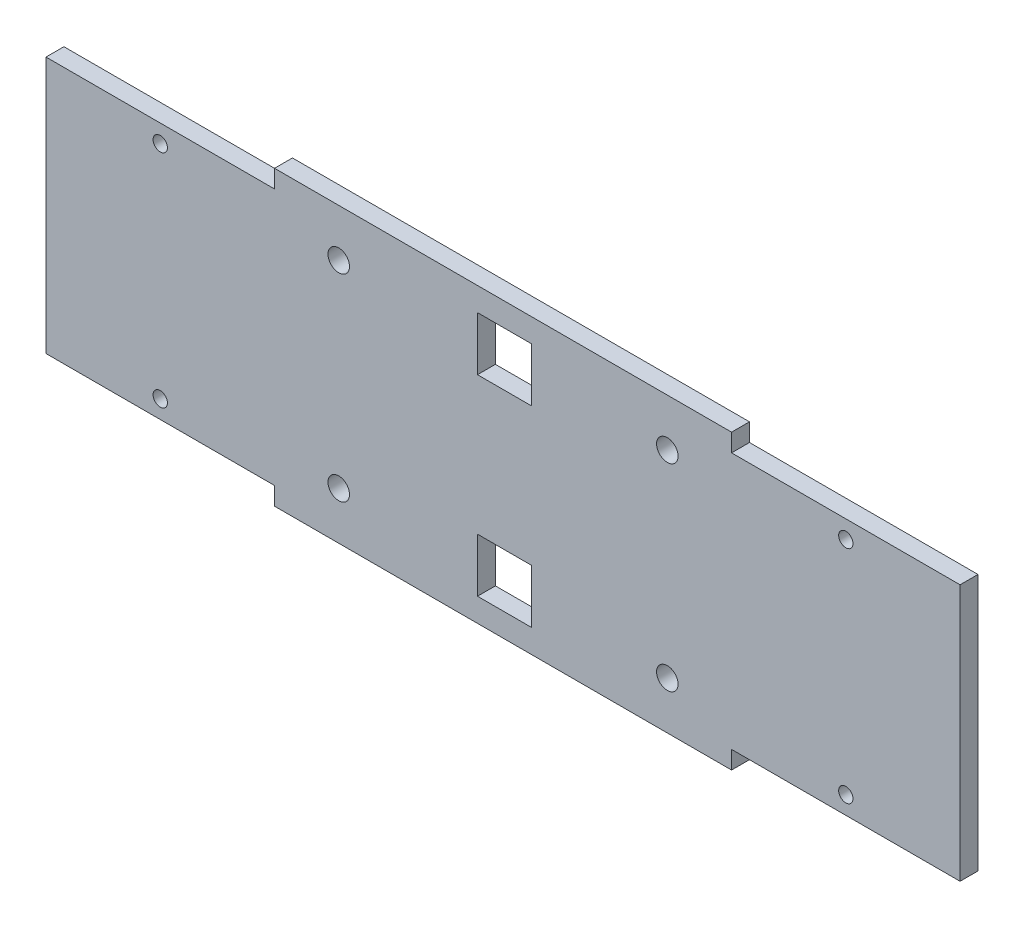
ISO-10303-21;
HEADER;
FILE_DESCRIPTION(('STEP AP214'),'2;1');
FILE_NAME('part.step','',(''),(''),'','','');
FILE_SCHEMA(('AUTOMOTIVE_DESIGN { 1 0 10303 214 1 1 1 1 }'));
ENDSEC;
DATA;
#1=APPLICATION_CONTEXT('core data for automotive mechanical design processes');
#2=APPLICATION_PROTOCOL_DEFINITION('international standard','automotive_design',2000,#1);
#3=PRODUCT_CONTEXT('',#1,'mechanical');
#4=PRODUCT('Part','Part','',(#3));
#5=PRODUCT_RELATED_PRODUCT_CATEGORY('part','',(#4));
#6=PRODUCT_DEFINITION_FORMATION('','',#4);
#7=PRODUCT_DEFINITION_CONTEXT('part definition',#1,'design');
#8=PRODUCT_DEFINITION('design','',#6,#7);
#9=PRODUCT_DEFINITION_SHAPE('','',#8);
#10=(LENGTH_UNIT() NAMED_UNIT(*) SI_UNIT(.MILLI.,.METRE.));
#11=(NAMED_UNIT(*) PLANE_ANGLE_UNIT() SI_UNIT($,.RADIAN.));
#12=(NAMED_UNIT(*) SI_UNIT($,.STERADIAN.) SOLID_ANGLE_UNIT());
#13=UNCERTAINTY_MEASURE_WITH_UNIT(LENGTH_MEASURE(1.E-05),#10,'distance_accuracy_value','');
#14=(GEOMETRIC_REPRESENTATION_CONTEXT(3) GLOBAL_UNCERTAINTY_ASSIGNED_CONTEXT((#13)) GLOBAL_UNIT_ASSIGNED_CONTEXT((#10,
#11,#12)) REPRESENTATION_CONTEXT('',''));
#15=CARTESIAN_POINT('',(0.,0.,0.));
#16=DIRECTION('',(0.,0.,1.));
#17=DIRECTION('',(1.,0.,0.));
#18=AXIS2_PLACEMENT_3D('',#15,#16,#17);
#19=CARTESIAN_POINT('',(0.,0.,5.));
#20=DIRECTION('',(0.,0.,1.));
#21=DIRECTION('',(1.,0.,0.));
#22=AXIS2_PLACEMENT_3D('',#19,#20,#21);
#23=PLANE('',#22);
#24=CARTESIAN_POINT('',(31.875,66.6376455792225,5.));
#25=DIRECTION('',(0.,0.,1.));
#26=DIRECTION('',(1.,0.,0.));
#27=AXIS2_PLACEMENT_3D('',#24,#25,#26);
#28=CIRCLE('',#27,2.);
#29=CARTESIAN_POINT('',(33.875,66.6376455792225,5.));
#30=VERTEX_POINT('',#29);
#31=EDGE_CURVE('E206',#30,#30,#28,.T.);
#32=ORIENTED_EDGE('',*,*,#31,.F.);
#33=EDGE_LOOP('',(#32));
#34=FACE_BOUND('',#33,.T.);
#35=CARTESIAN_POINT('',(223.125,4.99999999999999,5.));
#36=DIRECTION('',(0.,0.,1.));
#37=DIRECTION('',(1.,0.,0.));
#38=AXIS2_PLACEMENT_3D('',#35,#36,#37);
#39=CIRCLE('',#38,2.);
#40=CARTESIAN_POINT('',(225.125,4.99999999999999,5.));
#41=VERTEX_POINT('',#40);
#42=EDGE_CURVE('E518',#41,#41,#39,.T.);
#43=ORIENTED_EDGE('',*,*,#42,.F.);
#44=EDGE_LOOP('',(#43));
#45=FACE_BOUND('',#44,.T.);
#46=CARTESIAN_POINT('',(223.125,66.6376455792225,5.));
#47=DIRECTION('',(0.,0.,1.));
#48=DIRECTION('',(1.,0.,0.));
#49=AXIS2_PLACEMENT_3D('',#46,#47,#48);
#50=CIRCLE('',#49,2.);
#51=CARTESIAN_POINT('',(225.125,66.6376455792225,5.));
#52=VERTEX_POINT('',#51);
#53=EDGE_CURVE('E521',#52,#52,#50,.T.);
#54=ORIENTED_EDGE('',*,*,#53,.F.);
#55=EDGE_LOOP('',(#54));
#56=FACE_BOUND('',#55,.T.);
#57=CARTESIAN_POINT('',(31.875,4.99999999999999,5.));
#58=DIRECTION('',(0.,0.,1.));
#59=DIRECTION('',(1.,0.,0.));
#60=AXIS2_PLACEMENT_3D('',#57,#58,#59);
#61=CIRCLE('',#60,2.);
#62=CARTESIAN_POINT('',(33.875,4.99999999999999,5.));
#63=VERTEX_POINT('',#62);
#64=EDGE_CURVE('E524',#63,#63,#61,.T.);
#65=ORIENTED_EDGE('',*,*,#64,.F.);
#66=EDGE_LOOP('',(#65));
#67=FACE_BOUND('',#66,.T.);
#68=CARTESIAN_POINT('',(173.3315727,8.27911762961123,5.));
#69=DIRECTION('',(0.,0.,1.));
#70=DIRECTION('',(1.,0.,0.));
#71=AXIS2_PLACEMENT_3D('',#68,#69,#70);
#72=CIRCLE('',#71,2.99999999999999);
#73=CARTESIAN_POINT('',(176.3315727,8.27911762961123,5.));
#74=VERTEX_POINT('',#73);
#75=EDGE_CURVE('E267',#74,#74,#72,.T.);
#76=ORIENTED_EDGE('',*,*,#75,.F.);
#77=EDGE_LOOP('',(#76));
#78=FACE_BOUND('',#77,.T.);
#79=CARTESIAN_POINT('',(81.6684273,8.27911762961123,5.));
#80=DIRECTION('',(0.,0.,1.));
#81=DIRECTION('',(1.,0.,0.));
#82=AXIS2_PLACEMENT_3D('',#79,#80,#81);
#83=CIRCLE('',#82,3.00000000000001);
#84=CARTESIAN_POINT('',(84.6684273,8.27911762961123,5.));
#85=VERTEX_POINT('',#84);
#86=EDGE_CURVE('E429',#85,#85,#83,.T.);
#87=ORIENTED_EDGE('',*,*,#86,.F.);
#88=EDGE_LOOP('',(#87));
#89=FACE_BOUND('',#88,.T.);
#90=CARTESIAN_POINT('',(173.3315727,63.3585279496113,5.));
#91=DIRECTION('',(0.,0.,1.));
#92=DIRECTION('',(1.,0.,0.));
#93=AXIS2_PLACEMENT_3D('',#90,#91,#92);
#94=CIRCLE('',#93,2.99999999999999);
#95=CARTESIAN_POINT('',(176.3315727,63.3585279496113,5.));
#96=VERTEX_POINT('',#95);
#97=EDGE_CURVE('E438',#96,#96,#94,.T.);
#98=ORIENTED_EDGE('',*,*,#97,.F.);
#99=EDGE_LOOP('',(#98));
#100=FACE_BOUND('',#99,.T.);
#101=CARTESIAN_POINT('',(81.6684273,63.3585279496113,5.));
#102=DIRECTION('',(0.,0.,1.));
#103=DIRECTION('',(1.,0.,0.));
#104=AXIS2_PLACEMENT_3D('',#101,#102,#103);
#105=CIRCLE('',#104,3.00000000000001);
#106=CARTESIAN_POINT('',(84.6684273,63.3585279496113,5.));
#107=VERTEX_POINT('',#106);
#108=EDGE_CURVE('E441',#107,#107,#105,.T.);
#109=ORIENTED_EDGE('',*,*,#108,.F.);
#110=EDGE_LOOP('',(#109));
#111=FACE_BOUND('',#110,.T.);
#112=DIRECTION('',(-1.,0.,0.));
#113=VECTOR('',#112,1.);
#114=CARTESIAN_POINT('',(0.,16.5582352592225,5.));
#115=LINE('',#114,#113);
#116=CARTESIAN_POINT('',(135.370410972912,16.5582352592223,5.));
#117=VERTEX_POINT('',#116);
#118=CARTESIAN_POINT('',(120.370410972912,16.5582352592223,5.));
#119=VERTEX_POINT('',#118);
#120=EDGE_CURVE('E316',#117,#119,#115,.T.);
#121=ORIENTED_EDGE('',*,*,#120,.F.);
#122=DIRECTION('',(0.,-1.,0.));
#123=VECTOR('',#122,1.);
#124=CARTESIAN_POINT('',(135.370410972912,0.,5.));
#125=LINE('',#124,#123);
#126=CARTESIAN_POINT('',(135.370410972912,1.5582352592223,5.));
#127=VERTEX_POINT('',#126);
#128=EDGE_CURVE('E309',#117,#127,#125,.T.);
#129=ORIENTED_EDGE('',*,*,#128,.T.);
#130=DIRECTION('',(-1.,0.,0.));
#131=VECTOR('',#130,1.);
#132=CARTESIAN_POINT('',(0.,1.55823525922255,5.));
#133=LINE('',#132,#131);
#134=CARTESIAN_POINT('',(120.370410972912,1.55823525922233,5.));
#135=VERTEX_POINT('',#134);
#136=EDGE_CURVE('E450',#127,#135,#133,.T.);
#137=ORIENTED_EDGE('',*,*,#136,.T.);
#138=DIRECTION('',(0.,-1.,0.));
#139=VECTOR('',#138,1.);
#140=CARTESIAN_POINT('',(120.370410972912,-2.22730002909532E-13,5.));
#141=LINE('',#140,#139);
#142=EDGE_CURVE('E321',#119,#135,#141,.T.);
#143=ORIENTED_EDGE('',*,*,#142,.F.);
#144=EDGE_LOOP('',(#121,#129,#137,#143));
#145=FACE_BOUND('',#144,.T.);
#146=DIRECTION('',(1.,0.,0.));
#147=VECTOR('',#146,1.);
#148=CARTESIAN_POINT('',(0.,-5.,5.));
#149=LINE('',#148,#147);
#150=CARTESIAN_POINT('',(63.75,-5.,5.));
#151=VERTEX_POINT('',#150);
#152=CARTESIAN_POINT('',(191.25,-5.,5.));
#153=VERTEX_POINT('',#152);
#154=EDGE_CURVE('E453',#151,#153,#149,.T.);
#155=ORIENTED_EDGE('',*,*,#154,.T.);
#156=DIRECTION('',(0.,1.,0.));
#157=VECTOR('',#156,1.);
#158=CARTESIAN_POINT('',(191.25,0.,5.));
#159=LINE('',#158,#157);
#160=CARTESIAN_POINT('',(191.25,0.,5.));
#161=VERTEX_POINT('',#160);
#162=EDGE_CURVE('E456',#153,#161,#159,.T.);
#163=ORIENTED_EDGE('',*,*,#162,.T.);
#164=DIRECTION('',(1.,0.,0.));
#165=VECTOR('',#164,1.);
#166=CARTESIAN_POINT('',(0.,0.,5.));
#167=LINE('',#166,#165);
#168=CARTESIAN_POINT('',(255.,0.,5.));
#169=VERTEX_POINT('',#168);
#170=EDGE_CURVE('E458',#161,#169,#167,.T.);
#171=ORIENTED_EDGE('',*,*,#170,.T.);
#172=DIRECTION('',(0.,1.,0.));
#173=VECTOR('',#172,1.);
#174=CARTESIAN_POINT('',(255.,0.,5.));
#175=LINE('',#174,#173);
#176=CARTESIAN_POINT('',(255.,71.6376455792225,5.));
#177=VERTEX_POINT('',#176);
#178=EDGE_CURVE('E460',#169,#177,#175,.T.);
#179=ORIENTED_EDGE('',*,*,#178,.T.);
#180=DIRECTION('',(1.,0.,0.));
#181=VECTOR('',#180,1.);
#182=CARTESIAN_POINT('',(0.,71.6376455792225,5.));
#183=LINE('',#182,#181);
#184=CARTESIAN_POINT('',(191.25,71.6376455792225,5.));
#185=VERTEX_POINT('',#184);
#186=EDGE_CURVE('E462',#185,#177,#183,.T.);
#187=ORIENTED_EDGE('',*,*,#186,.F.);
#188=DIRECTION('',(0.,-1.,0.));
#189=VECTOR('',#188,1.);
#190=CARTESIAN_POINT('',(191.25,0.,5.));
#191=LINE('',#190,#189);
#192=CARTESIAN_POINT('',(191.25,76.6376455792225,5.));
#193=VERTEX_POINT('',#192);
#194=EDGE_CURVE('E465',#193,#185,#191,.T.);
#195=ORIENTED_EDGE('',*,*,#194,.F.);
#196=DIRECTION('',(1.,0.,0.));
#197=VECTOR('',#196,1.);
#198=CARTESIAN_POINT('',(0.,76.6376455792225,5.));
#199=LINE('',#198,#197);
#200=CARTESIAN_POINT('',(63.75,76.6376455792225,5.));
#201=VERTEX_POINT('',#200);
#202=EDGE_CURVE('E468',#201,#193,#199,.T.);
#203=ORIENTED_EDGE('',*,*,#202,.F.);
#204=DIRECTION('',(0.,1.,0.));
#205=VECTOR('',#204,1.);
#206=CARTESIAN_POINT('',(63.75,0.,5.));
#207=LINE('',#206,#205);
#208=CARTESIAN_POINT('',(63.75,71.6376455792225,5.));
#209=VERTEX_POINT('',#208);
#210=EDGE_CURVE('E471',#209,#201,#207,.T.);
#211=ORIENTED_EDGE('',*,*,#210,.F.);
#212=DIRECTION('',(1.,0.,0.));
#213=VECTOR('',#212,1.);
#214=CARTESIAN_POINT('',(0.,71.6376455792225,5.));
#215=LINE('',#214,#213);
#216=CARTESIAN_POINT('',(0.,71.6376455792225,5.));
#217=VERTEX_POINT('',#216);
#218=EDGE_CURVE('E474',#217,#209,#215,.T.);
#219=ORIENTED_EDGE('',*,*,#218,.F.);
#220=DIRECTION('',(0.,1.,0.));
#221=VECTOR('',#220,1.);
#222=CARTESIAN_POINT('',(0.,0.,5.));
#223=LINE('',#222,#221);
#224=CARTESIAN_POINT('',(0.,0.,5.));
#225=VERTEX_POINT('',#224);
#226=EDGE_CURVE('E477',#225,#217,#223,.T.);
#227=ORIENTED_EDGE('',*,*,#226,.F.);
#228=DIRECTION('',(1.,0.,0.));
#229=VECTOR('',#228,1.);
#230=CARTESIAN_POINT('',(0.,0.,5.));
#231=LINE('',#230,#229);
#232=CARTESIAN_POINT('',(63.75,0.,5.));
#233=VERTEX_POINT('',#232);
#234=EDGE_CURVE('E480',#225,#233,#231,.T.);
#235=ORIENTED_EDGE('',*,*,#234,.T.);
#236=DIRECTION('',(0.,-1.,0.));
#237=VECTOR('',#236,1.);
#238=CARTESIAN_POINT('',(63.75,0.,5.));
#239=LINE('',#238,#237);
#240=EDGE_CURVE('E482',#233,#151,#239,.T.);
#241=ORIENTED_EDGE('',*,*,#240,.T.);
#242=EDGE_LOOP('',(#155,#163,#171,#179,#187,#195,#203,#211,#219,#227,#235,#241));
#243=FACE_BOUND('',#242,.T.);
#244=DIRECTION('',(-1.,0.,0.));
#245=VECTOR('',#244,1.);
#246=CARTESIAN_POINT('',(0.,55.07941032,5.));
#247=LINE('',#246,#245);
#248=CARTESIAN_POINT('',(135.370410972912,55.07941032,5.));
#249=VERTEX_POINT('',#248);
#250=CARTESIAN_POINT('',(120.370410972912,55.07941032,5.));
#251=VERTEX_POINT('',#250);
#252=EDGE_CURVE('E185',#249,#251,#247,.T.);
#253=ORIENTED_EDGE('',*,*,#252,.T.);
#254=DIRECTION('',(0.,1.,0.));
#255=VECTOR('',#254,1.);
#256=CARTESIAN_POINT('',(120.370410972912,0.,5.));
#257=LINE('',#256,#255);
#258=CARTESIAN_POINT('',(120.370410972912,70.07941032,5.));
#259=VERTEX_POINT('',#258);
#260=EDGE_CURVE('E180',#251,#259,#257,.T.);
#261=ORIENTED_EDGE('',*,*,#260,.T.);
#262=DIRECTION('',(-1.,0.,0.));
#263=VECTOR('',#262,1.);
#264=CARTESIAN_POINT('',(0.,70.07941032,5.));
#265=LINE('',#264,#263);
#266=CARTESIAN_POINT('',(135.370410972912,70.07941032,5.));
#267=VERTEX_POINT('',#266);
#268=EDGE_CURVE('E184',#267,#259,#265,.T.);
#269=ORIENTED_EDGE('',*,*,#268,.F.);
#270=DIRECTION('',(0.,1.,0.));
#271=VECTOR('',#270,1.);
#272=CARTESIAN_POINT('',(135.370410972912,0.,5.));
#273=LINE('',#272,#271);
#274=EDGE_CURVE('E196',#249,#267,#273,.T.);
#275=ORIENTED_EDGE('',*,*,#274,.F.);
#276=EDGE_LOOP('',(#253,#261,#269,#275));
#277=FACE_BOUND('',#276,.T.);
#278=ADVANCED_FACE('F35',(#34,#45,#56,#67,#78,#89,#100,#111,#145,#243,#277),#23,.T.);
#279=CARTESIAN_POINT('',(0.,0.,0.));
#280=DIRECTION('',(0.,0.,1.));
#281=DIRECTION('',(1.,0.,0.));
#282=AXIS2_PLACEMENT_3D('',#279,#280,#281);
#283=PLANE('',#282);
#284=CARTESIAN_POINT('',(31.875,66.6376455792225,0.));
#285=DIRECTION('',(0.,0.,-1.));
#286=DIRECTION('',(-1.,0.,0.));
#287=AXIS2_PLACEMENT_3D('',#284,#285,#286);
#288=CIRCLE('',#287,2.);
#289=CARTESIAN_POINT('',(29.875,66.6376455792225,0.));
#290=VERTEX_POINT('',#289);
#291=EDGE_CURVE('E530',#290,#290,#288,.T.);
#292=ORIENTED_EDGE('',*,*,#291,.F.);
#293=EDGE_LOOP('',(#292));
#294=FACE_BOUND('',#293,.T.);
#295=CARTESIAN_POINT('',(223.125,4.99999999999999,0.));
#296=DIRECTION('',(0.,0.,-1.));
#297=DIRECTION('',(-1.,0.,0.));
#298=AXIS2_PLACEMENT_3D('',#295,#296,#297);
#299=CIRCLE('',#298,2.);
#300=CARTESIAN_POINT('',(221.125,4.99999999999999,0.));
#301=VERTEX_POINT('',#300);
#302=EDGE_CURVE('E531',#301,#301,#299,.T.);
#303=ORIENTED_EDGE('',*,*,#302,.F.);
#304=EDGE_LOOP('',(#303));
#305=FACE_BOUND('',#304,.T.);
#306=CARTESIAN_POINT('',(223.125,66.6376455792225,0.));
#307=DIRECTION('',(0.,0.,-1.));
#308=DIRECTION('',(-1.,0.,0.));
#309=AXIS2_PLACEMENT_3D('',#306,#307,#308);
#310=CIRCLE('',#309,2.);
#311=CARTESIAN_POINT('',(221.125,66.6376455792225,0.));
#312=VERTEX_POINT('',#311);
#313=EDGE_CURVE('E534',#312,#312,#310,.T.);
#314=ORIENTED_EDGE('',*,*,#313,.F.);
#315=EDGE_LOOP('',(#314));
#316=FACE_BOUND('',#315,.T.);
#317=CARTESIAN_POINT('',(31.875,4.99999999999999,0.));
#318=DIRECTION('',(0.,0.,-1.));
#319=DIRECTION('',(-1.,0.,0.));
#320=AXIS2_PLACEMENT_3D('',#317,#318,#319);
#321=CIRCLE('',#320,2.);
#322=CARTESIAN_POINT('',(29.875,4.99999999999999,0.));
#323=VERTEX_POINT('',#322);
#324=EDGE_CURVE('E527',#323,#323,#321,.T.);
#325=ORIENTED_EDGE('',*,*,#324,.F.);
#326=EDGE_LOOP('',(#325));
#327=FACE_BOUND('',#326,.T.);
#328=CARTESIAN_POINT('',(173.3315727,8.27911762961123,0.));
#329=DIRECTION('',(0.,0.,1.));
#330=DIRECTION('',(1.,0.,0.));
#331=AXIS2_PLACEMENT_3D('',#328,#329,#330);
#332=CIRCLE('',#331,2.99999999999999);
#333=CARTESIAN_POINT('',(176.3315727,8.27911762961123,0.));
#334=VERTEX_POINT('',#333);
#335=EDGE_CURVE('E202',#334,#334,#332,.T.);
#336=ORIENTED_EDGE('',*,*,#335,.T.);
#337=EDGE_LOOP('',(#336));
#338=FACE_BOUND('',#337,.T.);
#339=CARTESIAN_POINT('',(81.6684273,8.27911762961123,0.));
#340=DIRECTION('',(0.,0.,1.));
#341=DIRECTION('',(1.,0.,0.));
#342=AXIS2_PLACEMENT_3D('',#339,#340,#341);
#343=CIRCLE('',#342,3.00000000000001);
#344=CARTESIAN_POINT('',(84.6684273,8.27911762961123,0.));
#345=VERTEX_POINT('',#344);
#346=EDGE_CURVE('E205',#345,#345,#343,.T.);
#347=ORIENTED_EDGE('',*,*,#346,.T.);
#348=EDGE_LOOP('',(#347));
#349=FACE_BOUND('',#348,.T.);
#350=CARTESIAN_POINT('',(173.3315727,63.3585279496113,0.));
#351=DIRECTION('',(0.,0.,1.));
#352=DIRECTION('',(1.,0.,0.));
#353=AXIS2_PLACEMENT_3D('',#350,#351,#352);
#354=CIRCLE('',#353,2.99999999999999);
#355=CARTESIAN_POINT('',(176.3315727,63.3585279496113,0.));
#356=VERTEX_POINT('',#355);
#357=EDGE_CURVE('E209',#356,#356,#354,.T.);
#358=ORIENTED_EDGE('',*,*,#357,.T.);
#359=EDGE_LOOP('',(#358));
#360=FACE_BOUND('',#359,.T.);
#361=CARTESIAN_POINT('',(81.6684273,63.3585279496113,0.));
#362=DIRECTION('',(0.,0.,1.));
#363=DIRECTION('',(1.,0.,0.));
#364=AXIS2_PLACEMENT_3D('',#361,#362,#363);
#365=CIRCLE('',#364,3.00000000000001);
#366=CARTESIAN_POINT('',(84.6684273,63.3585279496113,0.));
#367=VERTEX_POINT('',#366);
#368=EDGE_CURVE('E212',#367,#367,#365,.T.);
#369=ORIENTED_EDGE('',*,*,#368,.T.);
#370=EDGE_LOOP('',(#369));
#371=FACE_BOUND('',#370,.T.);
#372=DIRECTION('',(-1.,0.,0.));
#373=VECTOR('',#372,1.);
#374=CARTESIAN_POINT('',(0.,16.5582352592225,0.));
#375=LINE('',#374,#373);
#376=CARTESIAN_POINT('',(135.370410972912,16.5582352592223,0.));
#377=VERTEX_POINT('',#376);
#378=CARTESIAN_POINT('',(120.370410972912,16.5582352592223,0.));
#379=VERTEX_POINT('',#378);
#380=EDGE_CURVE('E215',#377,#379,#375,.T.);
#381=ORIENTED_EDGE('',*,*,#380,.T.);
#382=DIRECTION('',(0.,-1.,0.));
#383=VECTOR('',#382,1.);
#384=CARTESIAN_POINT('',(120.370410972912,-2.22730002909532E-13,0.));
#385=LINE('',#384,#383);
#386=CARTESIAN_POINT('',(120.370410972912,1.55823525922233,0.));
#387=VERTEX_POINT('',#386);
#388=EDGE_CURVE('E224',#379,#387,#385,.T.);
#389=ORIENTED_EDGE('',*,*,#388,.T.);
#390=DIRECTION('',(-1.,0.,0.));
#391=VECTOR('',#390,1.);
#392=CARTESIAN_POINT('',(0.,1.55823525922255,0.));
#393=LINE('',#392,#391);
#394=CARTESIAN_POINT('',(135.370410972912,1.5582352592223,0.));
#395=VERTEX_POINT('',#394);
#396=EDGE_CURVE('E221',#395,#387,#393,.T.);
#397=ORIENTED_EDGE('',*,*,#396,.F.);
#398=DIRECTION('',(0.,-1.,0.));
#399=VECTOR('',#398,1.);
#400=CARTESIAN_POINT('',(135.370410972912,0.,0.));
#401=LINE('',#400,#399);
#402=EDGE_CURVE('E218',#377,#395,#401,.T.);
#403=ORIENTED_EDGE('',*,*,#402,.F.);
#404=EDGE_LOOP('',(#381,#389,#397,#403));
#405=FACE_BOUND('',#404,.T.);
#406=DIRECTION('',(1.,0.,0.));
#407=VECTOR('',#406,1.);
#408=CARTESIAN_POINT('',(0.,-5.,0.));
#409=LINE('',#408,#407);
#410=CARTESIAN_POINT('',(63.75,-5.,0.));
#411=VERTEX_POINT('',#410);
#412=CARTESIAN_POINT('',(191.25,-5.,0.));
#413=VERTEX_POINT('',#412);
#414=EDGE_CURVE('E227',#411,#413,#409,.T.);
#415=ORIENTED_EDGE('',*,*,#414,.F.);
#416=DIRECTION('',(0.,-1.,0.));
#417=VECTOR('',#416,1.);
#418=CARTESIAN_POINT('',(63.75,0.,0.));
#419=LINE('',#418,#417);
#420=CARTESIAN_POINT('',(63.75,0.,0.));
#421=VERTEX_POINT('',#420);
#422=EDGE_CURVE('E257',#421,#411,#419,.T.);
#423=ORIENTED_EDGE('',*,*,#422,.F.);
#424=DIRECTION('',(1.,0.,0.));
#425=VECTOR('',#424,1.);
#426=CARTESIAN_POINT('',(0.,0.,0.));
#427=LINE('',#426,#425);
#428=CARTESIAN_POINT('',(0.,0.,0.));
#429=VERTEX_POINT('',#428);
#430=EDGE_CURVE('E255',#429,#421,#427,.T.);
#431=ORIENTED_EDGE('',*,*,#430,.F.);
#432=DIRECTION('',(0.,1.,0.));
#433=VECTOR('',#432,1.);
#434=CARTESIAN_POINT('',(0.,0.,0.));
#435=LINE('',#434,#433);
#436=CARTESIAN_POINT('',(0.,71.6376455792225,0.));
#437=VERTEX_POINT('',#436);
#438=EDGE_CURVE('E252',#429,#437,#435,.T.);
#439=ORIENTED_EDGE('',*,*,#438,.T.);
#440=DIRECTION('',(1.,0.,0.));
#441=VECTOR('',#440,1.);
#442=CARTESIAN_POINT('',(0.,71.6376455792225,0.));
#443=LINE('',#442,#441);
#444=CARTESIAN_POINT('',(63.75,71.6376455792225,0.));
#445=VERTEX_POINT('',#444);
#446=EDGE_CURVE('E249',#437,#445,#443,.T.);
#447=ORIENTED_EDGE('',*,*,#446,.T.);
#448=DIRECTION('',(0.,1.,0.));
#449=VECTOR('',#448,1.);
#450=CARTESIAN_POINT('',(63.75,0.,0.));
#451=LINE('',#450,#449);
#452=CARTESIAN_POINT('',(63.75,76.6376455792225,0.));
#453=VERTEX_POINT('',#452);
#454=EDGE_CURVE('E246',#445,#453,#451,.T.);
#455=ORIENTED_EDGE('',*,*,#454,.T.);
#456=DIRECTION('',(1.,0.,0.));
#457=VECTOR('',#456,1.);
#458=CARTESIAN_POINT('',(0.,76.6376455792225,0.));
#459=LINE('',#458,#457);
#460=CARTESIAN_POINT('',(191.25,76.6376455792225,0.));
#461=VERTEX_POINT('',#460);
#462=EDGE_CURVE('E243',#453,#461,#459,.T.);
#463=ORIENTED_EDGE('',*,*,#462,.T.);
#464=DIRECTION('',(0.,-1.,0.));
#465=VECTOR('',#464,1.);
#466=CARTESIAN_POINT('',(191.25,0.,0.));
#467=LINE('',#466,#465);
#468=CARTESIAN_POINT('',(191.25,71.6376455792225,0.));
#469=VERTEX_POINT('',#468);
#470=EDGE_CURVE('E240',#461,#469,#467,.T.);
#471=ORIENTED_EDGE('',*,*,#470,.T.);
#472=DIRECTION('',(1.,0.,0.));
#473=VECTOR('',#472,1.);
#474=CARTESIAN_POINT('',(0.,71.6376455792225,0.));
#475=LINE('',#474,#473);
#476=CARTESIAN_POINT('',(255.,71.6376455792225,0.));
#477=VERTEX_POINT('',#476);
#478=EDGE_CURVE('E237',#469,#477,#475,.T.);
#479=ORIENTED_EDGE('',*,*,#478,.T.);
#480=DIRECTION('',(0.,1.,0.));
#481=VECTOR('',#480,1.);
#482=CARTESIAN_POINT('',(255.,0.,0.));
#483=LINE('',#482,#481);
#484=CARTESIAN_POINT('',(255.,0.,0.));
#485=VERTEX_POINT('',#484);
#486=EDGE_CURVE('E234',#485,#477,#483,.T.);
#487=ORIENTED_EDGE('',*,*,#486,.F.);
#488=DIRECTION('',(1.,0.,0.));
#489=VECTOR('',#488,1.);
#490=CARTESIAN_POINT('',(0.,0.,0.));
#491=LINE('',#490,#489);
#492=CARTESIAN_POINT('',(191.25,0.,0.));
#493=VERTEX_POINT('',#492);
#494=EDGE_CURVE('E232',#493,#485,#491,.T.);
#495=ORIENTED_EDGE('',*,*,#494,.F.);
#496=DIRECTION('',(0.,1.,0.));
#497=VECTOR('',#496,1.);
#498=CARTESIAN_POINT('',(191.25,0.,0.));
#499=LINE('',#498,#497);
#500=EDGE_CURVE('E230',#413,#493,#499,.T.);
#501=ORIENTED_EDGE('',*,*,#500,.F.);
#502=EDGE_LOOP('',(#415,#423,#431,#439,#447,#455,#463,#471,#479,#487,#495,#501));
#503=FACE_BOUND('',#502,.T.);
#504=DIRECTION('',(-1.,0.,0.));
#505=VECTOR('',#504,1.);
#506=CARTESIAN_POINT('',(0.,55.07941032,0.));
#507=LINE('',#506,#505);
#508=CARTESIAN_POINT('',(135.370410972912,55.07941032,0.));
#509=VERTEX_POINT('',#508);
#510=CARTESIAN_POINT('',(120.370410972912,55.07941032,0.));
#511=VERTEX_POINT('',#510);
#512=EDGE_CURVE('E259',#509,#511,#507,.T.);
#513=ORIENTED_EDGE('',*,*,#512,.F.);
#514=DIRECTION('',(0.,1.,0.));
#515=VECTOR('',#514,1.);
#516=CARTESIAN_POINT('',(135.370410972912,0.,0.));
#517=LINE('',#516,#515);
#518=CARTESIAN_POINT('',(135.370410972912,70.07941032,0.));
#519=VERTEX_POINT('',#518);
#520=EDGE_CURVE('E264',#509,#519,#517,.T.);
#521=ORIENTED_EDGE('',*,*,#520,.T.);
#522=DIRECTION('',(-1.,0.,0.));
#523=VECTOR('',#522,1.);
#524=CARTESIAN_POINT('',(0.,70.07941032,0.));
#525=LINE('',#524,#523);
#526=CARTESIAN_POINT('',(120.370410972912,70.07941032,0.));
#527=VERTEX_POINT('',#526);
#528=EDGE_CURVE('E262',#519,#527,#525,.T.);
#529=ORIENTED_EDGE('',*,*,#528,.T.);
#530=DIRECTION('',(0.,1.,0.));
#531=VECTOR('',#530,1.);
#532=CARTESIAN_POINT('',(120.370410972912,0.,0.));
#533=LINE('',#532,#531);
#534=EDGE_CURVE('E191',#511,#527,#533,.T.);
#535=ORIENTED_EDGE('',*,*,#534,.F.);
#536=EDGE_LOOP('',(#513,#521,#529,#535));
#537=FACE_BOUND('',#536,.T.);
#538=ADVANCED_FACE('F312',(#294,#305,#316,#327,#338,#349,#360,#371,#405,#503,#537),#283,.F.);
#539=CARTESIAN_POINT('',(0.,55.07941032,5.));
#540=DIRECTION('',(0.,-1.,0.));
#541=DIRECTION('',(0.,0.,-1.));
#542=AXIS2_PLACEMENT_3D('',#539,#540,#541);
#543=PLANE('',#542);
#544=ORIENTED_EDGE('',*,*,#512,.T.);
#545=DIRECTION('',(0.,0.,-1.));
#546=VECTOR('',#545,1.);
#547=CARTESIAN_POINT('',(120.370410972912,55.07941032,5.));
#548=LINE('',#547,#546);
#549=EDGE_CURVE('E11',#251,#511,#548,.T.);
#550=ORIENTED_EDGE('',*,*,#549,.F.);
#551=ORIENTED_EDGE('',*,*,#252,.F.);
#552=DIRECTION('',(0.,0.,-1.));
#553=VECTOR('',#552,1.);
#554=CARTESIAN_POINT('',(135.370410972912,55.07941032,5.));
#555=LINE('',#554,#553);
#556=EDGE_CURVE('E54',#249,#509,#555,.T.);
#557=ORIENTED_EDGE('',*,*,#556,.T.);
#558=EDGE_LOOP('',(#544,#550,#551,#557));
#559=FACE_BOUND('',#558,.T.);
#560=ADVANCED_FACE('F342',(#559),#543,.F.);
#561=CARTESIAN_POINT('',(120.370410972912,0.,5.));
#562=DIRECTION('',(-1.,0.,0.));
#563=DIRECTION('',(0.,0.,1.));
#564=AXIS2_PLACEMENT_3D('',#561,#562,#563);
#565=PLANE('',#564);
#566=ORIENTED_EDGE('',*,*,#534,.T.);
#567=DIRECTION('',(0.,0.,-1.));
#568=VECTOR('',#567,1.);
#569=CARTESIAN_POINT('',(120.370410972912,70.07941032,5.));
#570=LINE('',#569,#568);
#571=EDGE_CURVE('E45',#259,#527,#570,.T.);
#572=ORIENTED_EDGE('',*,*,#571,.F.);
#573=ORIENTED_EDGE('',*,*,#260,.F.);
#574=ORIENTED_EDGE('',*,*,#549,.T.);
#575=EDGE_LOOP('',(#566,#572,#573,#574));
#576=FACE_BOUND('',#575,.T.);
#577=ADVANCED_FACE('F190',(#576),#565,.F.);
#578=CARTESIAN_POINT('',(0.,70.07941032,5.));
#579=DIRECTION('',(0.,-1.,0.));
#580=DIRECTION('',(0.,0.,-1.));
#581=AXIS2_PLACEMENT_3D('',#578,#579,#580);
#582=PLANE('',#581);
#583=ORIENTED_EDGE('',*,*,#528,.F.);
#584=DIRECTION('',(0.,0.,-1.));
#585=VECTOR('',#584,1.);
#586=CARTESIAN_POINT('',(135.370410972912,70.07941032,5.));
#587=LINE('',#586,#585);
#588=EDGE_CURVE('E116',#267,#519,#587,.T.);
#589=ORIENTED_EDGE('',*,*,#588,.F.);
#590=ORIENTED_EDGE('',*,*,#268,.T.);
#591=ORIENTED_EDGE('',*,*,#571,.T.);
#592=EDGE_LOOP('',(#583,#589,#590,#591));
#593=FACE_BOUND('',#592,.T.);
#594=ADVANCED_FACE('F195',(#593),#582,.T.);
#595=CARTESIAN_POINT('',(0.,-5.,5.));
#596=DIRECTION('',(0.,1.,0.));
#597=DIRECTION('',(0.,0.,1.));
#598=AXIS2_PLACEMENT_3D('',#595,#596,#597);
#599=PLANE('',#598);
#600=ORIENTED_EDGE('',*,*,#414,.T.);
#601=DIRECTION('',(0.,0.,-1.));
#602=VECTOR('',#601,1.);
#603=CARTESIAN_POINT('',(191.25,-5.,5.));
#604=LINE('',#603,#602);
#605=EDGE_CURVE('E269',#153,#413,#604,.T.);
#606=ORIENTED_EDGE('',*,*,#605,.F.);
#607=ORIENTED_EDGE('',*,*,#154,.F.);
#608=DIRECTION('',(0.,0.,-1.));
#609=VECTOR('',#608,1.);
#610=CARTESIAN_POINT('',(63.75,-5.,5.));
#611=LINE('',#610,#609);
#612=EDGE_CURVE('E271',#151,#411,#611,.T.);
#613=ORIENTED_EDGE('',*,*,#612,.T.);
#614=EDGE_LOOP('',(#600,#606,#607,#613));
#615=FACE_BOUND('',#614,.T.);
#616=ADVANCED_FACE('F356',(#615),#599,.F.);
#617=CARTESIAN_POINT('',(191.25,0.,5.));
#618=DIRECTION('',(-1.,0.,0.));
#619=DIRECTION('',(0.,0.,1.));
#620=AXIS2_PLACEMENT_3D('',#617,#618,#619);
#621=PLANE('',#620);
#622=ORIENTED_EDGE('',*,*,#500,.T.);
#623=DIRECTION('',(0.,0.,-1.));
#624=VECTOR('',#623,1.);
#625=CARTESIAN_POINT('',(191.25,0.,5.));
#626=LINE('',#625,#624);
#627=EDGE_CURVE('E294',#161,#493,#626,.T.);
#628=ORIENTED_EDGE('',*,*,#627,.F.);
#629=ORIENTED_EDGE('',*,*,#162,.F.);
#630=ORIENTED_EDGE('',*,*,#605,.T.);
#631=EDGE_LOOP('',(#622,#628,#629,#630));
#632=FACE_BOUND('',#631,.T.);
#633=ADVANCED_FACE('F396',(#632),#621,.F.);
#634=CARTESIAN_POINT('',(0.,0.,5.));
#635=DIRECTION('',(0.,1.,0.));
#636=DIRECTION('',(0.,0.,1.));
#637=AXIS2_PLACEMENT_3D('',#634,#635,#636);
#638=PLANE('',#637);
#639=ORIENTED_EDGE('',*,*,#494,.T.);
#640=DIRECTION('',(0.,0.,-1.));
#641=VECTOR('',#640,1.);
#642=CARTESIAN_POINT('',(255.,0.,5.));
#643=LINE('',#642,#641);
#644=EDGE_CURVE('E291',#169,#485,#643,.T.);
#645=ORIENTED_EDGE('',*,*,#644,.F.);
#646=ORIENTED_EDGE('',*,*,#170,.F.);
#647=ORIENTED_EDGE('',*,*,#627,.T.);
#648=EDGE_LOOP('',(#639,#645,#646,#647));
#649=FACE_BOUND('',#648,.T.);
#650=ADVANCED_FACE('F392',(#649),#638,.F.);
#651=CARTESIAN_POINT('',(255.,0.,5.));
#652=DIRECTION('',(-1.,0.,0.));
#653=DIRECTION('',(0.,0.,1.));
#654=AXIS2_PLACEMENT_3D('',#651,#652,#653);
#655=PLANE('',#654);
#656=ORIENTED_EDGE('',*,*,#486,.T.);
#657=DIRECTION('',(0.,0.,-1.));
#658=VECTOR('',#657,1.);
#659=CARTESIAN_POINT('',(255.,71.6376455792225,5.));
#660=LINE('',#659,#658);
#661=EDGE_CURVE('E289',#177,#477,#660,.T.);
#662=ORIENTED_EDGE('',*,*,#661,.F.);
#663=ORIENTED_EDGE('',*,*,#178,.F.);
#664=ORIENTED_EDGE('',*,*,#644,.T.);
#665=EDGE_LOOP('',(#656,#662,#663,#664));
#666=FACE_BOUND('',#665,.T.);
#667=ADVANCED_FACE('F388',(#666),#655,.F.);
#668=CARTESIAN_POINT('',(0.,71.6376455792225,5.));
#669=DIRECTION('',(0.,1.,0.));
#670=DIRECTION('',(0.,0.,1.));
#671=AXIS2_PLACEMENT_3D('',#668,#669,#670);
#672=PLANE('',#671);
#673=ORIENTED_EDGE('',*,*,#478,.F.);
#674=DIRECTION('',(0.,0.,-1.));
#675=VECTOR('',#674,1.);
#676=CARTESIAN_POINT('',(191.25,71.6376455792225,5.));
#677=LINE('',#676,#675);
#678=EDGE_CURVE('E287',#185,#469,#677,.T.);
#679=ORIENTED_EDGE('',*,*,#678,.F.);
#680=ORIENTED_EDGE('',*,*,#186,.T.);
#681=ORIENTED_EDGE('',*,*,#661,.T.);
#682=EDGE_LOOP('',(#673,#679,#680,#681));
#683=FACE_BOUND('',#682,.T.);
#684=ADVANCED_FACE('F384',(#683),#672,.T.);
#685=CARTESIAN_POINT('',(191.25,0.,5.));
#686=DIRECTION('',(1.,0.,0.));
#687=DIRECTION('',(0.,0.,-1.));
#688=AXIS2_PLACEMENT_3D('',#685,#686,#687);
#689=PLANE('',#688);
#690=ORIENTED_EDGE('',*,*,#470,.F.);
#691=DIRECTION('',(0.,0.,-1.));
#692=VECTOR('',#691,1.);
#693=CARTESIAN_POINT('',(191.25,76.6376455792225,5.));
#694=LINE('',#693,#692);
#695=EDGE_CURVE('E285',#193,#461,#694,.T.);
#696=ORIENTED_EDGE('',*,*,#695,.F.);
#697=ORIENTED_EDGE('',*,*,#194,.T.);
#698=ORIENTED_EDGE('',*,*,#678,.T.);
#699=EDGE_LOOP('',(#690,#696,#697,#698));
#700=FACE_BOUND('',#699,.T.);
#701=ADVANCED_FACE('F380',(#700),#689,.T.);
#702=CARTESIAN_POINT('',(0.,76.6376455792225,5.));
#703=DIRECTION('',(0.,1.,0.));
#704=DIRECTION('',(0.,0.,1.));
#705=AXIS2_PLACEMENT_3D('',#702,#703,#704);
#706=PLANE('',#705);
#707=ORIENTED_EDGE('',*,*,#462,.F.);
#708=DIRECTION('',(0.,0.,-1.));
#709=VECTOR('',#708,1.);
#710=CARTESIAN_POINT('',(63.75,76.6376455792225,5.));
#711=LINE('',#710,#709);
#712=EDGE_CURVE('E283',#201,#453,#711,.T.);
#713=ORIENTED_EDGE('',*,*,#712,.F.);
#714=ORIENTED_EDGE('',*,*,#202,.T.);
#715=ORIENTED_EDGE('',*,*,#695,.T.);
#716=EDGE_LOOP('',(#707,#713,#714,#715));
#717=FACE_BOUND('',#716,.T.);
#718=ADVANCED_FACE('F376',(#717),#706,.T.);
#719=CARTESIAN_POINT('',(63.75,0.,5.));
#720=DIRECTION('',(-1.,0.,0.));
#721=DIRECTION('',(0.,0.,1.));
#722=AXIS2_PLACEMENT_3D('',#719,#720,#721);
#723=PLANE('',#722);
#724=ORIENTED_EDGE('',*,*,#454,.F.);
#725=DIRECTION('',(0.,0.,-1.));
#726=VECTOR('',#725,1.);
#727=CARTESIAN_POINT('',(63.75,71.6376455792225,5.));
#728=LINE('',#727,#726);
#729=EDGE_CURVE('E281',#209,#445,#728,.T.);
#730=ORIENTED_EDGE('',*,*,#729,.F.);
#731=ORIENTED_EDGE('',*,*,#210,.T.);
#732=ORIENTED_EDGE('',*,*,#712,.T.);
#733=EDGE_LOOP('',(#724,#730,#731,#732));
#734=FACE_BOUND('',#733,.T.);
#735=ADVANCED_FACE('F372',(#734),#723,.T.);
#736=CARTESIAN_POINT('',(0.,71.6376455792225,5.));
#737=DIRECTION('',(0.,1.,0.));
#738=DIRECTION('',(0.,0.,1.));
#739=AXIS2_PLACEMENT_3D('',#736,#737,#738);
#740=PLANE('',#739);
#741=ORIENTED_EDGE('',*,*,#446,.F.);
#742=DIRECTION('',(0.,0.,-1.));
#743=VECTOR('',#742,1.);
#744=CARTESIAN_POINT('',(0.,71.6376455792225,5.));
#745=LINE('',#744,#743);
#746=EDGE_CURVE('E279',#217,#437,#745,.T.);
#747=ORIENTED_EDGE('',*,*,#746,.F.);
#748=ORIENTED_EDGE('',*,*,#218,.T.);
#749=ORIENTED_EDGE('',*,*,#729,.T.);
#750=EDGE_LOOP('',(#741,#747,#748,#749));
#751=FACE_BOUND('',#750,.T.);
#752=ADVANCED_FACE('F368',(#751),#740,.T.);
#753=CARTESIAN_POINT('',(0.,0.,5.));
#754=DIRECTION('',(-1.,0.,0.));
#755=DIRECTION('',(0.,-1.,0.));
#756=AXIS2_PLACEMENT_3D('',#753,#754,#755);
#757=PLANE('',#756);
#758=ORIENTED_EDGE('',*,*,#438,.F.);
#759=DIRECTION('',(0.,0.,-1.));
#760=VECTOR('',#759,1.);
#761=CARTESIAN_POINT('',(0.,0.,5.));
#762=LINE('',#761,#760);
#763=EDGE_CURVE('E277',#225,#429,#762,.T.);
#764=ORIENTED_EDGE('',*,*,#763,.F.);
#765=ORIENTED_EDGE('',*,*,#226,.T.);
#766=ORIENTED_EDGE('',*,*,#746,.T.);
#767=EDGE_LOOP('',(#758,#764,#765,#766));
#768=FACE_BOUND('',#767,.T.);
#769=ADVANCED_FACE('F364',(#768),#757,.T.);
#770=CARTESIAN_POINT('',(0.,0.,5.));
#771=DIRECTION('',(0.,1.,0.));
#772=DIRECTION('',(0.,0.,1.));
#773=AXIS2_PLACEMENT_3D('',#770,#771,#772);
#774=PLANE('',#773);
#775=ORIENTED_EDGE('',*,*,#430,.T.);
#776=DIRECTION('',(0.,0.,-1.));
#777=VECTOR('',#776,1.);
#778=CARTESIAN_POINT('',(63.75,0.,5.));
#779=LINE('',#778,#777);
#780=EDGE_CURVE('E274',#233,#421,#779,.T.);
#781=ORIENTED_EDGE('',*,*,#780,.F.);
#782=ORIENTED_EDGE('',*,*,#234,.F.);
#783=ORIENTED_EDGE('',*,*,#763,.T.);
#784=EDGE_LOOP('',(#775,#781,#782,#783));
#785=FACE_BOUND('',#784,.T.);
#786=ADVANCED_FACE('F361',(#785),#774,.F.);
#787=CARTESIAN_POINT('',(0.,16.5582352592225,5.));
#788=DIRECTION('',(0.,-1.,0.));
#789=DIRECTION('',(1.,0.,0.));
#790=AXIS2_PLACEMENT_3D('',#787,#788,#789);
#791=PLANE('',#790);
#792=ORIENTED_EDGE('',*,*,#380,.F.);
#793=DIRECTION('',(0.,0.,-1.));
#794=VECTOR('',#793,1.);
#795=CARTESIAN_POINT('',(135.370410972912,16.5582352592223,5.));
#796=LINE('',#795,#794);
#797=EDGE_CURVE('E39',#117,#377,#796,.T.);
#798=ORIENTED_EDGE('',*,*,#797,.F.);
#799=ORIENTED_EDGE('',*,*,#120,.T.);
#800=DIRECTION('',(0.,0.,-1.));
#801=VECTOR('',#800,1.);
#802=CARTESIAN_POINT('',(120.370410972912,16.5582352592223,5.));
#803=LINE('',#802,#801);
#804=EDGE_CURVE('E198',#119,#379,#803,.T.);
#805=ORIENTED_EDGE('',*,*,#804,.T.);
#806=EDGE_LOOP('',(#792,#798,#799,#805));
#807=FACE_BOUND('',#806,.T.);
#808=ADVANCED_FACE('F315',(#807),#791,.T.);
#809=CARTESIAN_POINT('',(135.370410972912,0.,5.));
#810=DIRECTION('',(1.,0.,0.));
#811=DIRECTION('',(0.,0.,-1.));
#812=AXIS2_PLACEMENT_3D('',#809,#810,#811);
#813=PLANE('',#812);
#814=ORIENTED_EDGE('',*,*,#402,.T.);
#815=DIRECTION('',(0.,0.,-1.));
#816=VECTOR('',#815,1.);
#817=CARTESIAN_POINT('',(135.370410972912,1.5582352592223,5.));
#818=LINE('',#817,#816);
#819=EDGE_CURVE('E301',#127,#395,#818,.T.);
#820=ORIENTED_EDGE('',*,*,#819,.F.);
#821=ORIENTED_EDGE('',*,*,#128,.F.);
#822=ORIENTED_EDGE('',*,*,#797,.T.);
#823=EDGE_LOOP('',(#814,#820,#821,#822));
#824=FACE_BOUND('',#823,.T.);
#825=ADVANCED_FACE('F307',(#824),#813,.F.);
#826=CARTESIAN_POINT('',(0.,1.55823525922255,5.));
#827=DIRECTION('',(0.,-1.,0.));
#828=DIRECTION('',(1.,0.,0.));
#829=AXIS2_PLACEMENT_3D('',#826,#827,#828);
#830=PLANE('',#829);
#831=ORIENTED_EDGE('',*,*,#396,.T.);
#832=DIRECTION('',(0.,0.,-1.));
#833=VECTOR('',#832,1.);
#834=CARTESIAN_POINT('',(120.370410972912,1.55823525922233,5.));
#835=LINE('',#834,#833);
#836=EDGE_CURVE('E300',#135,#387,#835,.T.);
#837=ORIENTED_EDGE('',*,*,#836,.F.);
#838=ORIENTED_EDGE('',*,*,#136,.F.);
#839=ORIENTED_EDGE('',*,*,#819,.T.);
#840=EDGE_LOOP('',(#831,#837,#838,#839));
#841=FACE_BOUND('',#840,.T.);
#842=ADVANCED_FACE('F323',(#841),#830,.F.);
#843=CARTESIAN_POINT('',(63.75,0.,5.));
#844=DIRECTION('',(1.,0.,0.));
#845=DIRECTION('',(0.,0.,-1.));
#846=AXIS2_PLACEMENT_3D('',#843,#844,#845);
#847=PLANE('',#846);
#848=ORIENTED_EDGE('',*,*,#422,.T.);
#849=ORIENTED_EDGE('',*,*,#612,.F.);
#850=ORIENTED_EDGE('',*,*,#240,.F.);
#851=ORIENTED_EDGE('',*,*,#780,.T.);
#852=EDGE_LOOP('',(#848,#849,#850,#851));
#853=FACE_BOUND('',#852,.T.);
#854=ADVANCED_FACE('F325',(#853),#847,.F.);
#855=CARTESIAN_POINT('',(120.370410972912,-2.22730002909532E-13,5.));
#856=DIRECTION('',(1.,0.,0.));
#857=DIRECTION('',(0.,1.,0.));
#858=AXIS2_PLACEMENT_3D('',#855,#856,#857);
#859=PLANE('',#858);
#860=ORIENTED_EDGE('',*,*,#388,.F.);
#861=ORIENTED_EDGE('',*,*,#804,.F.);
#862=ORIENTED_EDGE('',*,*,#142,.T.);
#863=ORIENTED_EDGE('',*,*,#836,.T.);
#864=EDGE_LOOP('',(#860,#861,#862,#863));
#865=FACE_BOUND('',#864,.T.);
#866=ADVANCED_FACE('F320',(#865),#859,.T.);
#867=CARTESIAN_POINT('',(81.6684273,63.3585279496113,5.));
#868=DIRECTION('',(0.,0.,-1.));
#869=DIRECTION('',(-1.,0.,0.));
#870=AXIS2_PLACEMENT_3D('',#867,#868,#869);
#871=CYLINDRICAL_SURFACE('',#870,3.00000000000001);
#872=ORIENTED_EDGE('',*,*,#108,.T.);
#873=EDGE_LOOP('',(#872));
#874=FACE_BOUND('',#873,.T.);
#875=ORIENTED_EDGE('',*,*,#368,.F.);
#876=EDGE_LOOP('',(#875));
#877=FACE_BOUND('',#876,.T.);
#878=ADVANCED_FACE('F404',(#874,#877),#871,.F.);
#879=CARTESIAN_POINT('',(173.3315727,63.3585279496113,5.));
#880=DIRECTION('',(0.,0.,-1.));
#881=DIRECTION('',(-1.,0.,0.));
#882=AXIS2_PLACEMENT_3D('',#879,#880,#881);
#883=CYLINDRICAL_SURFACE('',#882,2.99999999999999);
#884=ORIENTED_EDGE('',*,*,#97,.T.);
#885=EDGE_LOOP('',(#884));
#886=FACE_BOUND('',#885,.T.);
#887=ORIENTED_EDGE('',*,*,#357,.F.);
#888=EDGE_LOOP('',(#887));
#889=FACE_BOUND('',#888,.T.);
#890=ADVANCED_FACE('F408',(#886,#889),#883,.F.);
#891=CARTESIAN_POINT('',(81.6684273,8.27911762961123,5.));
#892=DIRECTION('',(0.,0.,-1.));
#893=DIRECTION('',(-1.,0.,0.));
#894=AXIS2_PLACEMENT_3D('',#891,#892,#893);
#895=CYLINDRICAL_SURFACE('',#894,3.00000000000001);
#896=ORIENTED_EDGE('',*,*,#86,.T.);
#897=EDGE_LOOP('',(#896));
#898=FACE_BOUND('',#897,.T.);
#899=ORIENTED_EDGE('',*,*,#346,.F.);
#900=EDGE_LOOP('',(#899));
#901=FACE_BOUND('',#900,.T.);
#902=ADVANCED_FACE('F414',(#898,#901),#895,.F.);
#903=CARTESIAN_POINT('',(173.3315727,8.27911762961123,5.));
#904=DIRECTION('',(0.,0.,-1.));
#905=DIRECTION('',(-1.,0.,0.));
#906=AXIS2_PLACEMENT_3D('',#903,#904,#905);
#907=CYLINDRICAL_SURFACE('',#906,2.99999999999999);
#908=ORIENTED_EDGE('',*,*,#75,.T.);
#909=EDGE_LOOP('',(#908));
#910=FACE_BOUND('',#909,.T.);
#911=ORIENTED_EDGE('',*,*,#335,.F.);
#912=EDGE_LOOP('',(#911));
#913=FACE_BOUND('',#912,.T.);
#914=ADVANCED_FACE('F37',(#910,#913),#907,.F.);
#915=CARTESIAN_POINT('',(135.370410972912,0.,5.));
#916=DIRECTION('',(-1.,0.,0.));
#917=DIRECTION('',(0.,0.,1.));
#918=AXIS2_PLACEMENT_3D('',#915,#916,#917);
#919=PLANE('',#918);
#920=ORIENTED_EDGE('',*,*,#520,.F.);
#921=ORIENTED_EDGE('',*,*,#556,.F.);
#922=ORIENTED_EDGE('',*,*,#274,.T.);
#923=ORIENTED_EDGE('',*,*,#588,.T.);
#924=EDGE_LOOP('',(#920,#921,#922,#923));
#925=FACE_BOUND('',#924,.T.);
#926=ADVANCED_FACE('F351',(#925),#919,.T.);
#927=CARTESIAN_POINT('',(31.875,4.99999999999999,10.));
#928=DIRECTION('',(0.,0.,-1.));
#929=DIRECTION('',(-1.,0.,0.));
#930=AXIS2_PLACEMENT_3D('',#927,#928,#929);
#931=CYLINDRICAL_SURFACE('',#930,2.);
#932=ORIENTED_EDGE('',*,*,#64,.T.);
#933=EDGE_LOOP('',(#932));
#934=FACE_BOUND('',#933,.T.);
#935=ORIENTED_EDGE('',*,*,#324,.T.);
#936=EDGE_LOOP('',(#935));
#937=FACE_BOUND('',#936,.T.);
#938=ADVANCED_FACE('F348',(#934,#937),#931,.F.);
#939=CARTESIAN_POINT('',(223.125,66.6376455792225,10.));
#940=DIRECTION('',(0.,0.,-1.));
#941=DIRECTION('',(-1.,0.,0.));
#942=AXIS2_PLACEMENT_3D('',#939,#940,#941);
#943=CYLINDRICAL_SURFACE('',#942,2.);
#944=ORIENTED_EDGE('',*,*,#53,.T.);
#945=EDGE_LOOP('',(#944));
#946=FACE_BOUND('',#945,.T.);
#947=ORIENTED_EDGE('',*,*,#313,.T.);
#948=EDGE_LOOP('',(#947));
#949=FACE_BOUND('',#948,.T.);
#950=ADVANCED_FACE('F540',(#946,#949),#943,.F.);
#951=CARTESIAN_POINT('',(223.125,4.99999999999999,10.));
#952=DIRECTION('',(0.,0.,-1.));
#953=DIRECTION('',(-1.,0.,0.));
#954=AXIS2_PLACEMENT_3D('',#951,#952,#953);
#955=CYLINDRICAL_SURFACE('',#954,2.);
#956=ORIENTED_EDGE('',*,*,#42,.T.);
#957=EDGE_LOOP('',(#956));
#958=FACE_BOUND('',#957,.T.);
#959=ORIENTED_EDGE('',*,*,#302,.T.);
#960=EDGE_LOOP('',(#959));
#961=FACE_BOUND('',#960,.T.);
#962=ADVANCED_FACE('F553',(#958,#961),#955,.F.);
#963=CARTESIAN_POINT('',(31.875,66.6376455792225,10.));
#964=DIRECTION('',(0.,0.,-1.));
#965=DIRECTION('',(-1.,0.,0.));
#966=AXIS2_PLACEMENT_3D('',#963,#964,#965);
#967=CYLINDRICAL_SURFACE('',#966,2.);
#968=ORIENTED_EDGE('',*,*,#31,.T.);
#969=EDGE_LOOP('',(#968));
#970=FACE_BOUND('',#969,.T.);
#971=ORIENTED_EDGE('',*,*,#291,.T.);
#972=EDGE_LOOP('',(#971));
#973=FACE_BOUND('',#972,.T.);
#974=ADVANCED_FACE('F565',(#970,#973),#967,.F.);
#975=CLOSED_SHELL('',(#278,#538,#560,#577,#594,#616,#633,#650,#667,#684,#701,#718,#735,#752,
#769,#786,#808,#825,#842,#854,#866,#878,#890,#902,#914,#926,#938,#950,#962,#974));
#976=MANIFOLD_SOLID_BREP('B2',#975);
#977=ADVANCED_BREP_SHAPE_REPRESENTATION('',(#18,#976),#14);
#978=SHAPE_DEFINITION_REPRESENTATION(#9,#977);
ENDSEC;
END-ISO-10303-21;
